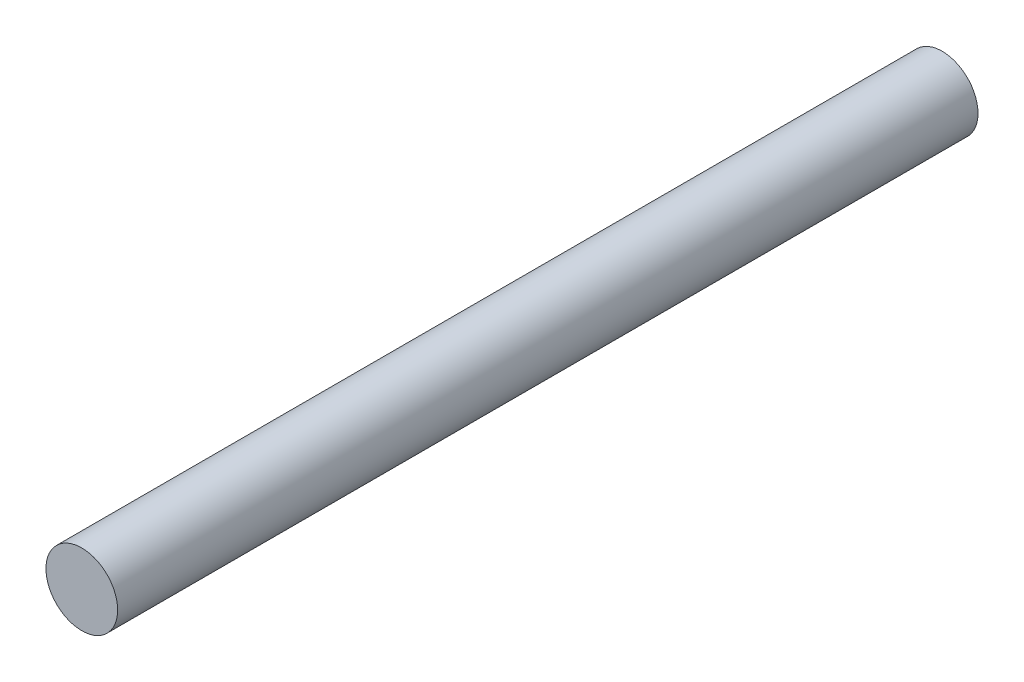
ISO-10303-21;
HEADER;
FILE_DESCRIPTION(('STEP AP214'),'2;1');
FILE_NAME('part.step','',(''),(''),'','','');
FILE_SCHEMA(('AUTOMOTIVE_DESIGN { 1 0 10303 214 1 1 1 1 }'));
ENDSEC;
DATA;
#1=APPLICATION_CONTEXT('core data for automotive mechanical design processes');
#2=APPLICATION_PROTOCOL_DEFINITION('international standard','automotive_design',2000,#1);
#3=PRODUCT_CONTEXT('',#1,'mechanical');
#4=PRODUCT('Part','Part','',(#3));
#5=PRODUCT_RELATED_PRODUCT_CATEGORY('part','',(#4));
#6=PRODUCT_DEFINITION_FORMATION('','',#4);
#7=PRODUCT_DEFINITION_CONTEXT('part definition',#1,'design');
#8=PRODUCT_DEFINITION('design','',#6,#7);
#9=PRODUCT_DEFINITION_SHAPE('','',#8);
#10=(LENGTH_UNIT() NAMED_UNIT(*) SI_UNIT(.MILLI.,.METRE.));
#11=(NAMED_UNIT(*) PLANE_ANGLE_UNIT() SI_UNIT($,.RADIAN.));
#12=(NAMED_UNIT(*) SI_UNIT($,.STERADIAN.) SOLID_ANGLE_UNIT());
#13=UNCERTAINTY_MEASURE_WITH_UNIT(LENGTH_MEASURE(1.E-05),#10,'distance_accuracy_value','');
#14=(GEOMETRIC_REPRESENTATION_CONTEXT(3) GLOBAL_UNCERTAINTY_ASSIGNED_CONTEXT((#13)) GLOBAL_UNIT_ASSIGNED_CONTEXT((#10,
#11,#12)) REPRESENTATION_CONTEXT('',''));
#15=CARTESIAN_POINT('',(0.,0.,0.));
#16=DIRECTION('',(0.,0.,1.));
#17=DIRECTION('',(1.,0.,0.));
#18=AXIS2_PLACEMENT_3D('',#15,#16,#17);
#19=CARTESIAN_POINT('',(0.,0.,60.));
#20=DIRECTION('',(0.,0.,-1.));
#21=DIRECTION('',(-1.,0.,0.));
#22=AXIS2_PLACEMENT_3D('',#19,#20,#21);
#23=CYLINDRICAL_SURFACE('',#22,2.5);
#24=CARTESIAN_POINT('',(0.,0.,60.));
#25=DIRECTION('',(0.,0.,1.));
#26=DIRECTION('',(1.,0.,0.));
#27=AXIS2_PLACEMENT_3D('',#24,#25,#26);
#28=CIRCLE('',#27,2.5);
#29=CARTESIAN_POINT('',(2.5,0.,60.));
#30=VERTEX_POINT('',#29);
#31=EDGE_CURVE('E10',#30,#30,#28,.T.);
#32=ORIENTED_EDGE('',*,*,#31,.F.);
#33=EDGE_LOOP('',(#32));
#34=FACE_BOUND('',#33,.T.);
#35=CARTESIAN_POINT('',(0.,0.,0.));
#36=DIRECTION('',(0.,0.,1.));
#37=DIRECTION('',(1.,0.,0.));
#38=AXIS2_PLACEMENT_3D('',#35,#36,#37);
#39=CIRCLE('',#38,2.5);
#40=CARTESIAN_POINT('',(2.5,0.,0.));
#41=VERTEX_POINT('',#40);
#42=EDGE_CURVE('E34',#41,#41,#39,.T.);
#43=ORIENTED_EDGE('',*,*,#42,.T.);
#44=EDGE_LOOP('',(#43));
#45=FACE_BOUND('',#44,.T.);
#46=ADVANCED_FACE('F31',(#34,#45),#23,.T.);
#47=CARTESIAN_POINT('',(0.,0.,60.));
#48=DIRECTION('',(0.,0.,1.));
#49=DIRECTION('',(1.,0.,0.));
#50=AXIS2_PLACEMENT_3D('',#47,#48,#49);
#51=PLANE('',#50);
#52=ORIENTED_EDGE('',*,*,#31,.T.);
#53=EDGE_LOOP('',(#52));
#54=FACE_BOUND('',#53,.T.);
#55=ADVANCED_FACE('F46',(#54),#51,.T.);
#56=CARTESIAN_POINT('',(0.,0.,0.));
#57=DIRECTION('',(0.,0.,1.));
#58=DIRECTION('',(1.,0.,0.));
#59=AXIS2_PLACEMENT_3D('',#56,#57,#58);
#60=PLANE('',#59);
#61=ORIENTED_EDGE('',*,*,#42,.F.);
#62=EDGE_LOOP('',(#61));
#63=FACE_BOUND('',#62,.T.);
#64=ADVANCED_FACE('F44',(#63),#60,.F.);
#65=CLOSED_SHELL('',(#46,#55,#64));
#66=MANIFOLD_SOLID_BREP('B2',#65);
#67=ADVANCED_BREP_SHAPE_REPRESENTATION('',(#18,#66),#14);
#68=SHAPE_DEFINITION_REPRESENTATION(#9,#67);
ENDSEC;
END-ISO-10303-21;
